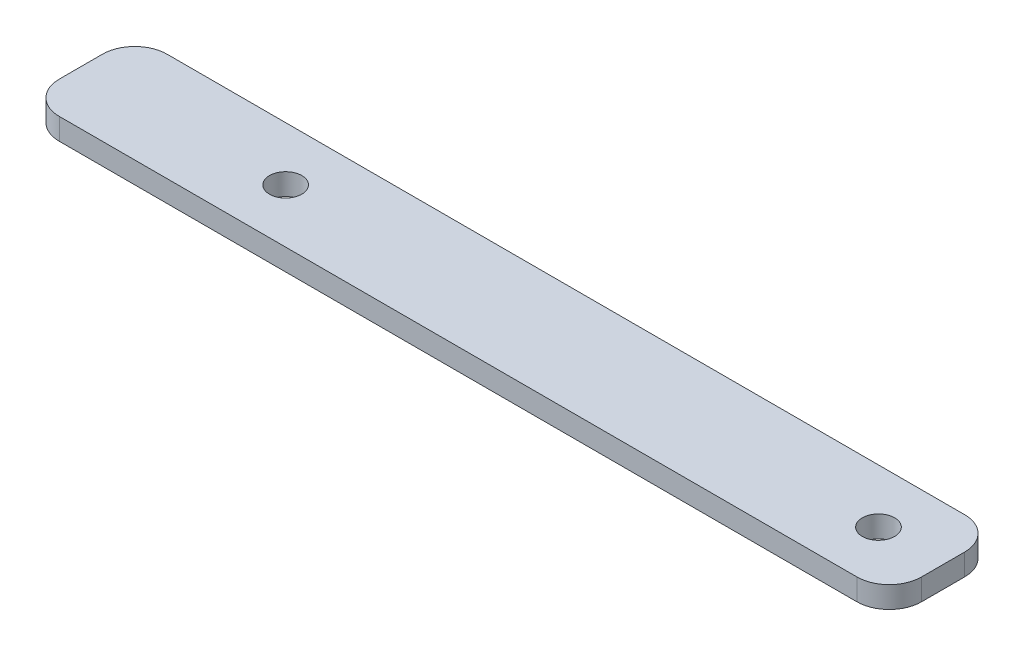
ISO-10303-21;
HEADER;
FILE_DESCRIPTION(('STEP AP214'),'2;1');
FILE_NAME('part.step','',(''),(''),'','','');
FILE_SCHEMA(('AUTOMOTIVE_DESIGN { 1 0 10303 214 1 1 1 1 }'));
ENDSEC;
DATA;
#1=APPLICATION_CONTEXT('core data for automotive mechanical design processes');
#2=APPLICATION_PROTOCOL_DEFINITION('international standard','automotive_design',2000,#1);
#3=PRODUCT_CONTEXT('',#1,'mechanical');
#4=PRODUCT('Part','Part','',(#3));
#5=PRODUCT_RELATED_PRODUCT_CATEGORY('part','',(#4));
#6=PRODUCT_DEFINITION_FORMATION('','',#4);
#7=PRODUCT_DEFINITION_CONTEXT('part definition',#1,'design');
#8=PRODUCT_DEFINITION('design','',#6,#7);
#9=PRODUCT_DEFINITION_SHAPE('','',#8);
#10=(LENGTH_UNIT() NAMED_UNIT(*) SI_UNIT(.MILLI.,.METRE.));
#11=(NAMED_UNIT(*) PLANE_ANGLE_UNIT() SI_UNIT($,.RADIAN.));
#12=(NAMED_UNIT(*) SI_UNIT($,.STERADIAN.) SOLID_ANGLE_UNIT());
#13=UNCERTAINTY_MEASURE_WITH_UNIT(LENGTH_MEASURE(1.E-05),#10,'distance_accuracy_value','');
#14=(GEOMETRIC_REPRESENTATION_CONTEXT(3) GLOBAL_UNCERTAINTY_ASSIGNED_CONTEXT((#13)) GLOBAL_UNIT_ASSIGNED_CONTEXT((#10,
#11,#12)) REPRESENTATION_CONTEXT('',''));
#15=CARTESIAN_POINT('',(0.,0.,0.));
#16=DIRECTION('',(0.,0.,1.));
#17=DIRECTION('',(1.,0.,0.));
#18=AXIS2_PLACEMENT_3D('',#15,#16,#17);
#19=CARTESIAN_POINT('',(0.,0.,0.));
#20=DIRECTION('',(0.,1.,0.));
#21=DIRECTION('',(0.,0.,1.));
#22=AXIS2_PLACEMENT_3D('',#19,#20,#21);
#23=PLANE('',#22);
#24=CARTESIAN_POINT('',(-21.,0.,0.));
#25=DIRECTION('',(0.,-1.,0.));
#26=DIRECTION('',(0.,0.,-1.));
#27=AXIS2_PLACEMENT_3D('',#24,#25,#26);
#28=CIRCLE('',#27,1.49999999999999);
#29=CARTESIAN_POINT('',(-21.,0.,-1.49999999999998));
#30=VERTEX_POINT('',#29);
#31=EDGE_CURVE('E176',#30,#30,#28,.T.);
#32=ORIENTED_EDGE('',*,*,#31,.F.);
#33=EDGE_LOOP('',(#32));
#34=FACE_BOUND('',#33,.T.);
#35=DIRECTION('',(1.,0.,0.));
#36=VECTOR('',#35,1.);
#37=CARTESIAN_POINT('',(-40.,0.,5.));
#38=LINE('',#37,#36);
#39=CARTESIAN_POINT('',(-37.,0.,5.));
#40=VERTEX_POINT('',#39);
#41=CARTESIAN_POINT('',(37.,0.,5.));
#42=VERTEX_POINT('',#41);
#43=EDGE_CURVE('E117',#40,#42,#38,.T.);
#44=ORIENTED_EDGE('',*,*,#43,.F.);
#45=CARTESIAN_POINT('',(-37.,0.,2.));
#46=DIRECTION('',(0.,1.,0.));
#47=DIRECTION('',(0.,0.,1.));
#48=AXIS2_PLACEMENT_3D('',#45,#46,#47);
#49=CIRCLE('',#48,3.);
#50=CARTESIAN_POINT('',(-40.,0.,2.));
#51=VERTEX_POINT('',#50);
#52=EDGE_CURVE('E100',#40,#51,#49,.F.);
#53=ORIENTED_EDGE('',*,*,#52,.T.);
#54=DIRECTION('',(0.,0.,1.));
#55=VECTOR('',#54,1.);
#56=CARTESIAN_POINT('',(-40.,0.,-5.));
#57=LINE('',#56,#55);
#58=CARTESIAN_POINT('',(-40.,0.,-2.));
#59=VERTEX_POINT('',#58);
#60=EDGE_CURVE('E128',#59,#51,#57,.T.);
#61=ORIENTED_EDGE('',*,*,#60,.F.);
#62=CARTESIAN_POINT('',(-37.,0.,-2.));
#63=DIRECTION('',(0.,1.,0.));
#64=DIRECTION('',(0.,0.,1.));
#65=AXIS2_PLACEMENT_3D('',#62,#63,#64);
#66=CIRCLE('',#65,3.);
#67=CARTESIAN_POINT('',(-37.,0.,-5.));
#68=VERTEX_POINT('',#67);
#69=EDGE_CURVE('E111',#59,#68,#66,.F.);
#70=ORIENTED_EDGE('',*,*,#69,.T.);
#71=DIRECTION('',(-1.,0.,0.));
#72=VECTOR('',#71,1.);
#73=CARTESIAN_POINT('',(-40.,0.,-5.));
#74=LINE('',#73,#72);
#75=CARTESIAN_POINT('',(37.,0.,-5.));
#76=VERTEX_POINT('',#75);
#77=EDGE_CURVE('E132',#76,#68,#74,.T.);
#78=ORIENTED_EDGE('',*,*,#77,.F.);
#79=CARTESIAN_POINT('',(37.,0.,-2.));
#80=DIRECTION('',(0.,1.,0.));
#81=DIRECTION('',(0.,0.,1.));
#82=AXIS2_PLACEMENT_3D('',#79,#80,#81);
#83=CIRCLE('',#82,3.);
#84=CARTESIAN_POINT('',(40.,0.,-2.));
#85=VERTEX_POINT('',#84);
#86=EDGE_CURVE('E121',#76,#85,#83,.F.);
#87=ORIENTED_EDGE('',*,*,#86,.T.);
#88=DIRECTION('',(0.,0.,-1.));
#89=VECTOR('',#88,1.);
#90=CARTESIAN_POINT('',(40.,0.,-5.));
#91=LINE('',#90,#89);
#92=CARTESIAN_POINT('',(40.,0.,2.));
#93=VERTEX_POINT('',#92);
#94=EDGE_CURVE('E159',#93,#85,#91,.T.);
#95=ORIENTED_EDGE('',*,*,#94,.F.);
#96=CARTESIAN_POINT('',(37.,0.,2.));
#97=DIRECTION('',(0.,1.,0.));
#98=DIRECTION('',(0.,0.,1.));
#99=AXIS2_PLACEMENT_3D('',#96,#97,#98);
#100=CIRCLE('',#99,3.);
#101=EDGE_CURVE('E126',#93,#42,#100,.F.);
#102=ORIENTED_EDGE('',*,*,#101,.T.);
#103=EDGE_LOOP('',(#44,#53,#61,#70,#78,#87,#95,#102));
#104=FACE_BOUND('',#103,.T.);
#105=CARTESIAN_POINT('',(34.,0.,0.));
#106=DIRECTION('',(0.,-1.,0.));
#107=DIRECTION('',(0.,0.,-1.));
#108=AXIS2_PLACEMENT_3D('',#105,#106,#107);
#109=CIRCLE('',#108,1.49999999999999);
#110=CARTESIAN_POINT('',(34.,0.,-1.49999999999998));
#111=VERTEX_POINT('',#110);
#112=EDGE_CURVE('E182',#111,#111,#109,.T.);
#113=ORIENTED_EDGE('',*,*,#112,.F.);
#114=EDGE_LOOP('',(#113));
#115=FACE_BOUND('',#114,.T.);
#116=ADVANCED_FACE('F33',(#34,#104,#115),#23,.F.);
#117=CARTESIAN_POINT('',(40.,2.,-5.));
#118=DIRECTION('',(-1.,0.,0.));
#119=DIRECTION('',(0.,0.,1.));
#120=AXIS2_PLACEMENT_3D('',#117,#118,#119);
#121=PLANE('',#120);
#122=DIRECTION('',(0.,0.,-1.));
#123=VECTOR('',#122,1.);
#124=CARTESIAN_POINT('',(40.,2.,-5.));
#125=LINE('',#124,#123);
#126=CARTESIAN_POINT('',(40.,2.,2.));
#127=VERTEX_POINT('',#126);
#128=CARTESIAN_POINT('',(40.,2.,-2.));
#129=VERTEX_POINT('',#128);
#130=EDGE_CURVE('E127',#127,#129,#125,.T.);
#131=ORIENTED_EDGE('',*,*,#130,.F.);
#132=DIRECTION('',(0.,-1.,0.));
#133=VECTOR('',#132,1.);
#134=CARTESIAN_POINT('',(40.,2.,2.));
#135=LINE('',#134,#133);
#136=EDGE_CURVE('E11',#127,#93,#135,.T.);
#137=ORIENTED_EDGE('',*,*,#136,.T.);
#138=ORIENTED_EDGE('',*,*,#94,.T.);
#139=DIRECTION('',(0.,-1.,0.));
#140=VECTOR('',#139,1.);
#141=CARTESIAN_POINT('',(40.,2.,-2.));
#142=LINE('',#141,#140);
#143=EDGE_CURVE('E41',#85,#129,#142,.F.);
#144=ORIENTED_EDGE('',*,*,#143,.T.);
#145=EDGE_LOOP('',(#131,#137,#138,#144));
#146=FACE_BOUND('',#145,.T.);
#147=ADVANCED_FACE('F157',(#146),#121,.F.);
#148=CARTESIAN_POINT('',(-40.,2.,-5.));
#149=DIRECTION('',(0.,0.,1.));
#150=DIRECTION('',(1.,0.,0.));
#151=AXIS2_PLACEMENT_3D('',#148,#149,#150);
#152=PLANE('',#151);
#153=ORIENTED_EDGE('',*,*,#77,.T.);
#154=DIRECTION('',(0.,-1.,0.));
#155=VECTOR('',#154,1.);
#156=CARTESIAN_POINT('',(-37.,2.,-5.));
#157=LINE('',#156,#155);
#158=CARTESIAN_POINT('',(-37.,2.,-5.));
#159=VERTEX_POINT('',#158);
#160=EDGE_CURVE('E48',#68,#159,#157,.F.);
#161=ORIENTED_EDGE('',*,*,#160,.T.);
#162=DIRECTION('',(-1.,0.,0.));
#163=VECTOR('',#162,1.);
#164=CARTESIAN_POINT('',(-40.,2.,-5.));
#165=LINE('',#164,#163);
#166=CARTESIAN_POINT('',(37.,2.,-5.));
#167=VERTEX_POINT('',#166);
#168=EDGE_CURVE('E130',#167,#159,#165,.T.);
#169=ORIENTED_EDGE('',*,*,#168,.F.);
#170=DIRECTION('',(0.,-1.,0.));
#171=VECTOR('',#170,1.);
#172=CARTESIAN_POINT('',(37.,2.,-5.));
#173=LINE('',#172,#171);
#174=EDGE_CURVE('E150',#167,#76,#173,.T.);
#175=ORIENTED_EDGE('',*,*,#174,.T.);
#176=EDGE_LOOP('',(#153,#161,#169,#175));
#177=FACE_BOUND('',#176,.T.);
#178=ADVANCED_FACE('F166',(#177),#152,.F.);
#179=CARTESIAN_POINT('',(-40.,2.,-5.));
#180=DIRECTION('',(1.,0.,0.));
#181=DIRECTION('',(0.,0.,-1.));
#182=AXIS2_PLACEMENT_3D('',#179,#180,#181);
#183=PLANE('',#182);
#184=ORIENTED_EDGE('',*,*,#60,.T.);
#185=DIRECTION('',(0.,-1.,0.));
#186=VECTOR('',#185,1.);
#187=CARTESIAN_POINT('',(-40.,2.,2.));
#188=LINE('',#187,#186);
#189=CARTESIAN_POINT('',(-40.,2.,2.));
#190=VERTEX_POINT('',#189);
#191=EDGE_CURVE('E105',#51,#190,#188,.F.);
#192=ORIENTED_EDGE('',*,*,#191,.T.);
#193=DIRECTION('',(0.,0.,1.));
#194=VECTOR('',#193,1.);
#195=CARTESIAN_POINT('',(-40.,2.,-5.));
#196=LINE('',#195,#194);
#197=CARTESIAN_POINT('',(-40.,2.,-2.));
#198=VERTEX_POINT('',#197);
#199=EDGE_CURVE('E171',#198,#190,#196,.T.);
#200=ORIENTED_EDGE('',*,*,#199,.F.);
#201=DIRECTION('',(0.,-1.,0.));
#202=VECTOR('',#201,1.);
#203=CARTESIAN_POINT('',(-40.,2.,-2.));
#204=LINE('',#203,#202);
#205=EDGE_CURVE('E110',#198,#59,#204,.T.);
#206=ORIENTED_EDGE('',*,*,#205,.T.);
#207=EDGE_LOOP('',(#184,#192,#200,#206));
#208=FACE_BOUND('',#207,.T.);
#209=ADVANCED_FACE('F200',(#208),#183,.F.);
#210=CARTESIAN_POINT('',(-40.,2.,5.));
#211=DIRECTION('',(0.,0.,-1.));
#212=DIRECTION('',(-1.,0.,0.));
#213=AXIS2_PLACEMENT_3D('',#210,#211,#212);
#214=PLANE('',#213);
#215=DIRECTION('',(1.,0.,0.));
#216=VECTOR('',#215,1.);
#217=CARTESIAN_POINT('',(-40.,2.,5.));
#218=LINE('',#217,#216);
#219=CARTESIAN_POINT('',(-37.,2.,5.));
#220=VERTEX_POINT('',#219);
#221=CARTESIAN_POINT('',(37.,2.,5.));
#222=VERTEX_POINT('',#221);
#223=EDGE_CURVE('E120',#220,#222,#218,.T.);
#224=ORIENTED_EDGE('',*,*,#223,.F.);
#225=DIRECTION('',(0.,-1.,0.));
#226=VECTOR('',#225,1.);
#227=CARTESIAN_POINT('',(-37.,2.,5.));
#228=LINE('',#227,#226);
#229=EDGE_CURVE('E104',#220,#40,#228,.T.);
#230=ORIENTED_EDGE('',*,*,#229,.T.);
#231=ORIENTED_EDGE('',*,*,#43,.T.);
#232=DIRECTION('',(0.,-1.,0.));
#233=VECTOR('',#232,1.);
#234=CARTESIAN_POINT('',(37.,2.,5.));
#235=LINE('',#234,#233);
#236=EDGE_CURVE('E122',#42,#222,#235,.F.);
#237=ORIENTED_EDGE('',*,*,#236,.T.);
#238=EDGE_LOOP('',(#224,#230,#231,#237));
#239=FACE_BOUND('',#238,.T.);
#240=ADVANCED_FACE('F116',(#239),#214,.F.);
#241=CARTESIAN_POINT('',(0.,2.,0.));
#242=DIRECTION('',(0.,1.,0.));
#243=DIRECTION('',(0.,0.,1.));
#244=AXIS2_PLACEMENT_3D('',#241,#242,#243);
#245=PLANE('',#244);
#246=CARTESIAN_POINT('',(34.,2.,0.));
#247=DIRECTION('',(0.,-1.,0.));
#248=DIRECTION('',(0.,0.,-1.));
#249=AXIS2_PLACEMENT_3D('',#246,#247,#248);
#250=CIRCLE('',#249,1.5);
#251=CARTESIAN_POINT('',(34.,2.,-1.49999999999999));
#252=VERTEX_POINT('',#251);
#253=EDGE_CURVE('E179',#252,#252,#250,.T.);
#254=ORIENTED_EDGE('',*,*,#253,.T.);
#255=EDGE_LOOP('',(#254));
#256=FACE_BOUND('',#255,.T.);
#257=CARTESIAN_POINT('',(-21.,2.,0.));
#258=DIRECTION('',(0.,-1.,0.));
#259=DIRECTION('',(0.,0.,-1.));
#260=AXIS2_PLACEMENT_3D('',#257,#258,#259);
#261=CIRCLE('',#260,1.5);
#262=CARTESIAN_POINT('',(-21.,2.,-1.49999999999999));
#263=VERTEX_POINT('',#262);
#264=EDGE_CURVE('E167',#263,#263,#261,.T.);
#265=ORIENTED_EDGE('',*,*,#264,.T.);
#266=EDGE_LOOP('',(#265));
#267=FACE_BOUND('',#266,.T.);
#268=ORIENTED_EDGE('',*,*,#199,.T.);
#269=CARTESIAN_POINT('',(-37.,2.,2.));
#270=DIRECTION('',(0.,1.,0.));
#271=DIRECTION('',(0.,0.,1.));
#272=AXIS2_PLACEMENT_3D('',#269,#270,#271);
#273=CIRCLE('',#272,3.);
#274=EDGE_CURVE('E148',#190,#220,#273,.T.);
#275=ORIENTED_EDGE('',*,*,#274,.T.);
#276=ORIENTED_EDGE('',*,*,#223,.T.);
#277=CARTESIAN_POINT('',(37.,2.,2.));
#278=DIRECTION('',(0.,1.,0.));
#279=DIRECTION('',(0.,0.,1.));
#280=AXIS2_PLACEMENT_3D('',#277,#278,#279);
#281=CIRCLE('',#280,3.);
#282=EDGE_CURVE('E144',#222,#127,#281,.T.);
#283=ORIENTED_EDGE('',*,*,#282,.T.);
#284=ORIENTED_EDGE('',*,*,#130,.T.);
#285=CARTESIAN_POINT('',(37.,2.,-2.));
#286=DIRECTION('',(0.,1.,0.));
#287=DIRECTION('',(0.,0.,1.));
#288=AXIS2_PLACEMENT_3D('',#285,#286,#287);
#289=CIRCLE('',#288,3.);
#290=EDGE_CURVE('E55',#129,#167,#289,.T.);
#291=ORIENTED_EDGE('',*,*,#290,.T.);
#292=ORIENTED_EDGE('',*,*,#168,.T.);
#293=CARTESIAN_POINT('',(-37.,2.,-2.));
#294=DIRECTION('',(0.,1.,0.));
#295=DIRECTION('',(0.,0.,1.));
#296=AXIS2_PLACEMENT_3D('',#293,#294,#295);
#297=CIRCLE('',#296,3.);
#298=EDGE_CURVE('E146',#159,#198,#297,.T.);
#299=ORIENTED_EDGE('',*,*,#298,.T.);
#300=EDGE_LOOP('',(#268,#275,#276,#283,#284,#291,#292,#299));
#301=FACE_BOUND('',#300,.T.);
#302=ADVANCED_FACE('F162',(#256,#267,#301),#245,.T.);
#303=CARTESIAN_POINT('',(-37.,2.,2.));
#304=DIRECTION('',(0.,-1.,0.));
#305=DIRECTION('',(0.,0.,-1.));
#306=AXIS2_PLACEMENT_3D('',#303,#304,#305);
#307=CYLINDRICAL_SURFACE('',#306,3.);
#308=ORIENTED_EDGE('',*,*,#274,.F.);
#309=ORIENTED_EDGE('',*,*,#191,.F.);
#310=ORIENTED_EDGE('',*,*,#52,.F.);
#311=ORIENTED_EDGE('',*,*,#229,.F.);
#312=EDGE_LOOP('',(#308,#309,#310,#311));
#313=FACE_BOUND('',#312,.T.);
#314=ADVANCED_FACE('F103',(#313),#307,.T.);
#315=CARTESIAN_POINT('',(-37.,2.,-2.));
#316=DIRECTION('',(0.,-1.,0.));
#317=DIRECTION('',(0.,0.,-1.));
#318=AXIS2_PLACEMENT_3D('',#315,#316,#317);
#319=CYLINDRICAL_SURFACE('',#318,3.);
#320=ORIENTED_EDGE('',*,*,#298,.F.);
#321=ORIENTED_EDGE('',*,*,#160,.F.);
#322=ORIENTED_EDGE('',*,*,#69,.F.);
#323=ORIENTED_EDGE('',*,*,#205,.F.);
#324=EDGE_LOOP('',(#320,#321,#322,#323));
#325=FACE_BOUND('',#324,.T.);
#326=ADVANCED_FACE('F208',(#325),#319,.T.);
#327=CARTESIAN_POINT('',(37.,2.,2.));
#328=DIRECTION('',(0.,-1.,0.));
#329=DIRECTION('',(0.,0.,-1.));
#330=AXIS2_PLACEMENT_3D('',#327,#328,#329);
#331=CYLINDRICAL_SURFACE('',#330,3.);
#332=ORIENTED_EDGE('',*,*,#282,.F.);
#333=ORIENTED_EDGE('',*,*,#236,.F.);
#334=ORIENTED_EDGE('',*,*,#101,.F.);
#335=ORIENTED_EDGE('',*,*,#136,.F.);
#336=EDGE_LOOP('',(#332,#333,#334,#335));
#337=FACE_BOUND('',#336,.T.);
#338=ADVANCED_FACE('F210',(#337),#331,.T.);
#339=CARTESIAN_POINT('',(37.,2.,-2.));
#340=DIRECTION('',(0.,-1.,0.));
#341=DIRECTION('',(0.,0.,-1.));
#342=AXIS2_PLACEMENT_3D('',#339,#340,#341);
#343=CYLINDRICAL_SURFACE('',#342,3.);
#344=ORIENTED_EDGE('',*,*,#290,.F.);
#345=ORIENTED_EDGE('',*,*,#143,.F.);
#346=ORIENTED_EDGE('',*,*,#86,.F.);
#347=ORIENTED_EDGE('',*,*,#174,.F.);
#348=EDGE_LOOP('',(#344,#345,#346,#347));
#349=FACE_BOUND('',#348,.T.);
#350=ADVANCED_FACE('F35',(#349),#343,.T.);
#351=CARTESIAN_POINT('',(-21.,0.,0.));
#352=DIRECTION('',(0.,-1.,0.));
#353=DIRECTION('',(0.,0.,-1.));
#354=AXIS2_PLACEMENT_3D('',#351,#352,#353);
#355=CYLINDRICAL_SURFACE('',#354,1.49999999999999);
#356=ORIENTED_EDGE('',*,*,#264,.F.);
#357=EDGE_LOOP('',(#356));
#358=FACE_BOUND('',#357,.T.);
#359=ORIENTED_EDGE('',*,*,#31,.T.);
#360=EDGE_LOOP('',(#359));
#361=FACE_BOUND('',#360,.T.);
#362=ADVANCED_FACE('F217',(#358,#361),#355,.F.);
#363=CARTESIAN_POINT('',(34.,0.,0.));
#364=DIRECTION('',(0.,-1.,0.));
#365=DIRECTION('',(0.,0.,-1.));
#366=AXIS2_PLACEMENT_3D('',#363,#364,#365);
#367=CYLINDRICAL_SURFACE('',#366,1.49999999999999);
#368=ORIENTED_EDGE('',*,*,#253,.F.);
#369=EDGE_LOOP('',(#368));
#370=FACE_BOUND('',#369,.T.);
#371=ORIENTED_EDGE('',*,*,#112,.T.);
#372=EDGE_LOOP('',(#371));
#373=FACE_BOUND('',#372,.T.);
#374=ADVANCED_FACE('F186',(#370,#373),#367,.F.);
#375=CLOSED_SHELL('',(#116,#147,#178,#209,#240,#302,#314,#326,#338,#350,#362,#374));
#376=MANIFOLD_SOLID_BREP('B2',#375);
#377=ADVANCED_BREP_SHAPE_REPRESENTATION('',(#18,#376),#14);
#378=SHAPE_DEFINITION_REPRESENTATION(#9,#377);
ENDSEC;
END-ISO-10303-21;
